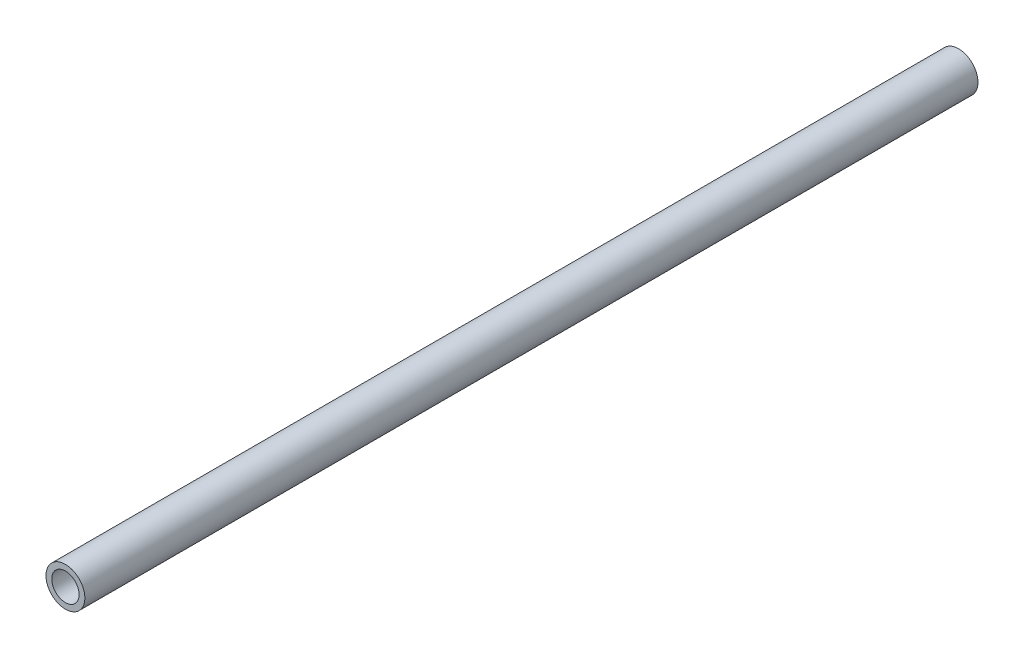
ISO-10303-21;
HEADER;
FILE_DESCRIPTION(('STEP AP214'),'2;1');
FILE_NAME('part.step','',(''),(''),'','','');
FILE_SCHEMA(('AUTOMOTIVE_DESIGN { 1 0 10303 214 1 1 1 1 }'));
ENDSEC;
DATA;
#1=APPLICATION_CONTEXT('core data for automotive mechanical design processes');
#2=APPLICATION_PROTOCOL_DEFINITION('international standard','automotive_design',2000,#1);
#3=PRODUCT_CONTEXT('',#1,'mechanical');
#4=PRODUCT('Part','Part','',(#3));
#5=PRODUCT_RELATED_PRODUCT_CATEGORY('part','',(#4));
#6=PRODUCT_DEFINITION_FORMATION('','',#4);
#7=PRODUCT_DEFINITION_CONTEXT('part definition',#1,'design');
#8=PRODUCT_DEFINITION('design','',#6,#7);
#9=PRODUCT_DEFINITION_SHAPE('','',#8);
#10=(LENGTH_UNIT() NAMED_UNIT(*) SI_UNIT(.MILLI.,.METRE.));
#11=(NAMED_UNIT(*) PLANE_ANGLE_UNIT() SI_UNIT($,.RADIAN.));
#12=(NAMED_UNIT(*) SI_UNIT($,.STERADIAN.) SOLID_ANGLE_UNIT());
#13=UNCERTAINTY_MEASURE_WITH_UNIT(LENGTH_MEASURE(1.E-05),#10,'distance_accuracy_value','');
#14=(GEOMETRIC_REPRESENTATION_CONTEXT(3) GLOBAL_UNCERTAINTY_ASSIGNED_CONTEXT((#13)) GLOBAL_UNIT_ASSIGNED_CONTEXT((#10,
#11,#12)) REPRESENTATION_CONTEXT('',''));
#15=CARTESIAN_POINT('',(0.,0.,0.));
#16=DIRECTION('',(0.,0.,1.));
#17=DIRECTION('',(1.,0.,0.));
#18=AXIS2_PLACEMENT_3D('',#15,#16,#17);
#19=CARTESIAN_POINT('',(347.5,-20.,620.));
#20=DIRECTION('',(0.,0.,1.));
#21=DIRECTION('',(1.,0.,0.));
#22=AXIS2_PLACEMENT_3D('',#19,#20,#21);
#23=PLANE('',#22);
#24=CARTESIAN_POINT('',(347.5,-20.,620.));
#25=DIRECTION('',(0.,0.,1.));
#26=DIRECTION('',(1.,0.,0.));
#27=AXIS2_PLACEMENT_3D('',#24,#25,#26);
#28=CIRCLE('',#27,13.5);
#29=CARTESIAN_POINT('',(361.,-20.,620.));
#30=VERTEX_POINT('',#29);
#31=EDGE_CURVE('E10',#30,#30,#28,.T.);
#32=ORIENTED_EDGE('',*,*,#31,.T.);
#33=EDGE_LOOP('',(#32));
#34=FACE_BOUND('',#33,.T.);
#35=CARTESIAN_POINT('',(347.5,-20.,620.));
#36=DIRECTION('',(0.,0.,1.));
#37=DIRECTION('',(1.,0.,0.));
#38=AXIS2_PLACEMENT_3D('',#35,#36,#37);
#39=CIRCLE('',#38,9.50000000000001);
#40=CARTESIAN_POINT('',(357.,-20.,620.));
#41=VERTEX_POINT('',#40);
#42=EDGE_CURVE('E43',#41,#41,#39,.T.);
#43=ORIENTED_EDGE('',*,*,#42,.F.);
#44=EDGE_LOOP('',(#43));
#45=FACE_BOUND('',#44,.T.);
#46=ADVANCED_FACE('F32',(#34,#45),#23,.T.);
#47=CARTESIAN_POINT('',(347.5,-20.,0.));
#48=DIRECTION('',(0.,0.,1.));
#49=DIRECTION('',(1.,0.,0.));
#50=AXIS2_PLACEMENT_3D('',#47,#48,#49);
#51=PLANE('',#50);
#52=CARTESIAN_POINT('',(347.5,-20.,0.));
#53=DIRECTION('',(0.,0.,1.));
#54=DIRECTION('',(1.,0.,0.));
#55=AXIS2_PLACEMENT_3D('',#52,#53,#54);
#56=CIRCLE('',#55,13.5);
#57=CARTESIAN_POINT('',(361.,-20.,0.));
#58=VERTEX_POINT('',#57);
#59=EDGE_CURVE('E36',#58,#58,#56,.T.);
#60=ORIENTED_EDGE('',*,*,#59,.F.);
#61=EDGE_LOOP('',(#60));
#62=FACE_BOUND('',#61,.T.);
#63=CARTESIAN_POINT('',(347.5,-20.,0.));
#64=DIRECTION('',(0.,0.,1.));
#65=DIRECTION('',(1.,0.,0.));
#66=AXIS2_PLACEMENT_3D('',#63,#64,#65);
#67=CIRCLE('',#66,9.50000000000001);
#68=CARTESIAN_POINT('',(357.,-20.,0.));
#69=VERTEX_POINT('',#68);
#70=EDGE_CURVE('E45',#69,#69,#67,.T.);
#71=ORIENTED_EDGE('',*,*,#70,.T.);
#72=EDGE_LOOP('',(#71));
#73=FACE_BOUND('',#72,.T.);
#74=ADVANCED_FACE('F55',(#62,#73),#51,.F.);
#75=CARTESIAN_POINT('',(347.5,-20.,620.));
#76=DIRECTION('',(0.,0.,-1.));
#77=DIRECTION('',(-1.,0.,0.));
#78=AXIS2_PLACEMENT_3D('',#75,#76,#77);
#79=CYLINDRICAL_SURFACE('',#78,13.5);
#80=ORIENTED_EDGE('',*,*,#31,.F.);
#81=EDGE_LOOP('',(#80));
#82=FACE_BOUND('',#81,.T.);
#83=ORIENTED_EDGE('',*,*,#59,.T.);
#84=EDGE_LOOP('',(#83));
#85=FACE_BOUND('',#84,.T.);
#86=ADVANCED_FACE('F34',(#82,#85),#79,.T.);
#87=CARTESIAN_POINT('',(347.5,-20.,620.));
#88=DIRECTION('',(0.,0.,-1.));
#89=DIRECTION('',(-1.,0.,0.));
#90=AXIS2_PLACEMENT_3D('',#87,#88,#89);
#91=CYLINDRICAL_SURFACE('',#90,9.50000000000001);
#92=ORIENTED_EDGE('',*,*,#42,.T.);
#93=EDGE_LOOP('',(#92));
#94=FACE_BOUND('',#93,.T.);
#95=ORIENTED_EDGE('',*,*,#70,.F.);
#96=EDGE_LOOP('',(#95));
#97=FACE_BOUND('',#96,.T.);
#98=ADVANCED_FACE('F51',(#94,#97),#91,.F.);
#99=CLOSED_SHELL('',(#46,#74,#86,#98));
#100=MANIFOLD_SOLID_BREP('B2',#99);
#101=ADVANCED_BREP_SHAPE_REPRESENTATION('',(#18,#100),#14);
#102=SHAPE_DEFINITION_REPRESENTATION(#9,#101);
ENDSEC;
END-ISO-10303-21;
